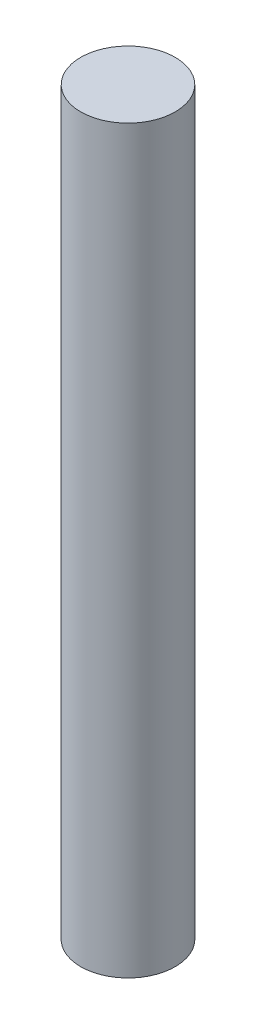
ISO-10303-21;
HEADER;
FILE_DESCRIPTION(('STEP AP214'),'2;1');
FILE_NAME('part.step','',(''),(''),'','','');
FILE_SCHEMA(('AUTOMOTIVE_DESIGN { 1 0 10303 214 1 1 1 1 }'));
ENDSEC;
DATA;
#1=APPLICATION_CONTEXT('core data for automotive mechanical design processes');
#2=APPLICATION_PROTOCOL_DEFINITION('international standard','automotive_design',2000,#1);
#3=PRODUCT_CONTEXT('',#1,'mechanical');
#4=PRODUCT('Part','Part','',(#3));
#5=PRODUCT_RELATED_PRODUCT_CATEGORY('part','',(#4));
#6=PRODUCT_DEFINITION_FORMATION('','',#4);
#7=PRODUCT_DEFINITION_CONTEXT('part definition',#1,'design');
#8=PRODUCT_DEFINITION('design','',#6,#7);
#9=PRODUCT_DEFINITION_SHAPE('','',#8);
#10=(LENGTH_UNIT() NAMED_UNIT(*) SI_UNIT(.MILLI.,.METRE.));
#11=(NAMED_UNIT(*) PLANE_ANGLE_UNIT() SI_UNIT($,.RADIAN.));
#12=(NAMED_UNIT(*) SI_UNIT($,.STERADIAN.) SOLID_ANGLE_UNIT());
#13=UNCERTAINTY_MEASURE_WITH_UNIT(LENGTH_MEASURE(1.E-05),#10,'distance_accuracy_value','');
#14=(GEOMETRIC_REPRESENTATION_CONTEXT(3) GLOBAL_UNCERTAINTY_ASSIGNED_CONTEXT((#13)) GLOBAL_UNIT_ASSIGNED_CONTEXT((#10,
#11,#12)) REPRESENTATION_CONTEXT('',''));
#15=CARTESIAN_POINT('',(0.,0.,0.));
#16=DIRECTION('',(0.,0.,1.));
#17=DIRECTION('',(1.,0.,0.));
#18=AXIS2_PLACEMENT_3D('',#15,#16,#17);
#19=CARTESIAN_POINT('',(3.,-23.5,0.));
#20=DIRECTION('',(0.,1.,0.));
#21=DIRECTION('',(0.,0.,1.));
#22=AXIS2_PLACEMENT_3D('',#19,#20,#21);
#23=PLANE('',#22);
#24=CARTESIAN_POINT('',(0.,-23.5,0.));
#25=DIRECTION('',(0.,1.,0.));
#26=DIRECTION('',(0.,0.,1.));
#27=AXIS2_PLACEMENT_3D('',#24,#25,#26);
#28=CIRCLE('',#27,3.);
#29=CARTESIAN_POINT('',(0.,-23.5,3.));
#30=VERTEX_POINT('',#29);
#31=EDGE_CURVE('E18',#30,#30,#28,.T.);
#32=ORIENTED_EDGE('',*,*,#31,.F.);
#33=EDGE_LOOP('',(#32));
#34=FACE_BOUND('',#33,.T.);
#35=ADVANCED_FACE('F15',(#34),#23,.F.);
#36=CARTESIAN_POINT('',(0.,23.5,0.));
#37=DIRECTION('',(0.,-1.,0.));
#38=DIRECTION('',(0.,0.,-1.));
#39=AXIS2_PLACEMENT_3D('',#36,#37,#38);
#40=PLANE('',#39);
#41=CARTESIAN_POINT('',(0.,23.5,0.));
#42=DIRECTION('',(0.,1.,0.));
#43=DIRECTION('',(0.,0.,1.));
#44=AXIS2_PLACEMENT_3D('',#41,#42,#43);
#45=CIRCLE('',#44,3.);
#46=CARTESIAN_POINT('',(0.,23.5,3.));
#47=VERTEX_POINT('',#46);
#48=EDGE_CURVE('E10',#47,#47,#45,.F.);
#49=ORIENTED_EDGE('',*,*,#48,.F.);
#50=EDGE_LOOP('',(#49));
#51=FACE_BOUND('',#50,.T.);
#52=ADVANCED_FACE('F30',(#51),#40,.F.);
#53=CARTESIAN_POINT('',(0.,-23.5,0.));
#54=DIRECTION('',(0.,1.,0.));
#55=DIRECTION('',(0.,0.,1.));
#56=AXIS2_PLACEMENT_3D('',#53,#54,#55);
#57=CYLINDRICAL_SURFACE('',#56,3.);
#58=ORIENTED_EDGE('',*,*,#48,.T.);
#59=EDGE_LOOP('',(#58));
#60=FACE_BOUND('',#59,.T.);
#61=ORIENTED_EDGE('',*,*,#31,.T.);
#62=EDGE_LOOP('',(#61));
#63=FACE_BOUND('',#62,.T.);
#64=ADVANCED_FACE('F27',(#60,#63),#57,.T.);
#65=CLOSED_SHELL('',(#35,#52,#64));
#66=MANIFOLD_SOLID_BREP('B1',#65);
#67=ADVANCED_BREP_SHAPE_REPRESENTATION('',(#18,#66),#14);
#68=SHAPE_DEFINITION_REPRESENTATION(#9,#67);
ENDSEC;
END-ISO-10303-21;
